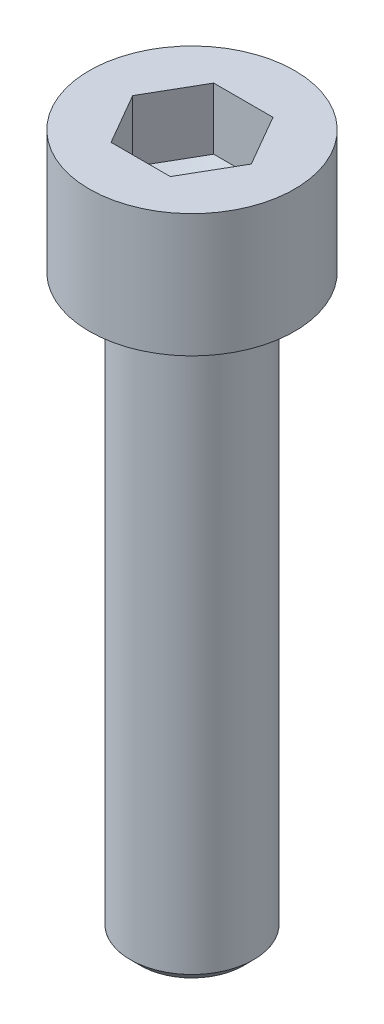
ISO-10303-21;
HEADER;
FILE_DESCRIPTION(('STEP AP214'),'2;1');
FILE_NAME('part.step','',(''),(''),'','','');
FILE_SCHEMA(('AUTOMOTIVE_DESIGN { 1 0 10303 214 1 1 1 1 }'));
ENDSEC;
DATA;
#1=APPLICATION_CONTEXT('core data for automotive mechanical design processes');
#2=APPLICATION_PROTOCOL_DEFINITION('international standard','automotive_design',2000,#1);
#3=PRODUCT_CONTEXT('',#1,'mechanical');
#4=PRODUCT('Part','Part','',(#3));
#5=PRODUCT_RELATED_PRODUCT_CATEGORY('part','',(#4));
#6=PRODUCT_DEFINITION_FORMATION('','',#4);
#7=PRODUCT_DEFINITION_CONTEXT('part definition',#1,'design');
#8=PRODUCT_DEFINITION('design','',#6,#7);
#9=PRODUCT_DEFINITION_SHAPE('','',#8);
#10=(LENGTH_UNIT() NAMED_UNIT(*) SI_UNIT(.MILLI.,.METRE.));
#11=(NAMED_UNIT(*) PLANE_ANGLE_UNIT() SI_UNIT($,.RADIAN.));
#12=(NAMED_UNIT(*) SI_UNIT($,.STERADIAN.) SOLID_ANGLE_UNIT());
#13=UNCERTAINTY_MEASURE_WITH_UNIT(LENGTH_MEASURE(1.E-05),#10,'distance_accuracy_value','');
#14=(GEOMETRIC_REPRESENTATION_CONTEXT(3) GLOBAL_UNCERTAINTY_ASSIGNED_CONTEXT((#13)) GLOBAL_UNIT_ASSIGNED_CONTEXT((#10,
#11,#12)) REPRESENTATION_CONTEXT('',''));
#15=CARTESIAN_POINT('',(0.,0.,0.));
#16=DIRECTION('',(0.,0.,1.));
#17=DIRECTION('',(1.,0.,0.));
#18=AXIS2_PLACEMENT_3D('',#15,#16,#17);
#19=CARTESIAN_POINT('',(0.,-27.5,0.));
#20=DIRECTION('',(0.,1.,0.));
#21=DIRECTION('',(0.,0.,-1.));
#22=AXIS2_PLACEMENT_3D('',#19,#20,#21);
#23=CONICAL_SURFACE('',#22,3.,0.785398163397449);
#24=CARTESIAN_POINT('',(0.,-28.,0.));
#25=DIRECTION('',(0.,-1.,0.));
#26=DIRECTION('',(0.,0.,-1.));
#27=AXIS2_PLACEMENT_3D('',#24,#25,#26);
#28=CIRCLE('',#27,2.5);
#29=CARTESIAN_POINT('',(0.,-28.,-2.5));
#30=VERTEX_POINT('',#29);
#31=EDGE_CURVE('E11',#30,#30,#28,.T.);
#32=ORIENTED_EDGE('',*,*,#31,.F.);
#33=EDGE_LOOP('',(#32));
#34=FACE_BOUND('',#33,.T.);
#35=CARTESIAN_POINT('',(0.,-27.5,0.));
#36=DIRECTION('',(0.,-1.,0.));
#37=DIRECTION('',(0.,0.,-1.));
#38=AXIS2_PLACEMENT_3D('',#35,#36,#37);
#39=CIRCLE('',#38,3.);
#40=CARTESIAN_POINT('',(0.,-27.5,-3.));
#41=VERTEX_POINT('',#40);
#42=EDGE_CURVE('E47',#41,#41,#39,.T.);
#43=ORIENTED_EDGE('',*,*,#42,.T.);
#44=EDGE_LOOP('',(#43));
#45=FACE_BOUND('',#44,.T.);
#46=ADVANCED_FACE('F41',(#34,#45),#23,.T.);
#47=CARTESIAN_POINT('',(0.,-28.,0.));
#48=DIRECTION('',(0.,-1.,0.));
#49=DIRECTION('',(0.,0.,-1.));
#50=AXIS2_PLACEMENT_3D('',#47,#48,#49);
#51=PLANE('',#50);
#52=ORIENTED_EDGE('',*,*,#31,.T.);
#53=EDGE_LOOP('',(#52));
#54=FACE_BOUND('',#53,.T.);
#55=ADVANCED_FACE('F56',(#54),#51,.T.);
#56=CARTESIAN_POINT('',(0.,-27.5,0.));
#57=DIRECTION('',(0.,-1.,0.));
#58=DIRECTION('',(0.,0.,-1.));
#59=AXIS2_PLACEMENT_3D('',#56,#57,#58);
#60=PLANE('',#59);
#61=ORIENTED_EDGE('',*,*,#42,.F.);
#62=EDGE_LOOP('',(#61));
#63=FACE_BOUND('',#62,.T.);
#64=ADVANCED_FACE('F54',(#63),#60,.F.);
#65=CLOSED_SHELL('',(#46,#55,#64));
#66=MANIFOLD_SOLID_BREP('B2',#65);
#67=CARTESIAN_POINT('',(0.,0.,0.));
#68=DIRECTION('',(0.,1.,0.));
#69=DIRECTION('',(0.,0.,1.));
#70=AXIS2_PLACEMENT_3D('',#67,#68,#69);
#71=PLANE('',#70);
#72=CARTESIAN_POINT('',(0.,0.,0.));
#73=DIRECTION('',(0.,1.,0.));
#74=DIRECTION('',(0.,0.,1.));
#75=AXIS2_PLACEMENT_3D('',#72,#73,#74);
#76=CIRCLE('',#75,5.);
#77=CARTESIAN_POINT('',(0.,0.,5.));
#78=VERTEX_POINT('',#77);
#79=EDGE_CURVE('E159',#78,#78,#76,.T.);
#80=ORIENTED_EDGE('',*,*,#79,.F.);
#81=EDGE_LOOP('',(#80));
#82=FACE_BOUND('',#81,.T.);
#83=CARTESIAN_POINT('',(0.,0.,0.));
#84=DIRECTION('',(0.,1.,0.));
#85=DIRECTION('',(0.,0.,1.));
#86=AXIS2_PLACEMENT_3D('',#83,#84,#85);
#87=CIRCLE('',#86,3.);
#88=CARTESIAN_POINT('',(0.,0.,3.));
#89=VERTEX_POINT('',#88);
#90=EDGE_CURVE('E39',#89,#89,#87,.F.);
#91=ORIENTED_EDGE('',*,*,#90,.F.);
#92=EDGE_LOOP('',(#91));
#93=FACE_BOUND('',#92,.T.);
#94=ADVANCED_FACE('F82',(#82,#93),#71,.F.);
#95=CARTESIAN_POINT('',(0.,6.,0.));
#96=DIRECTION('',(0.,-1.,0.));
#97=DIRECTION('',(0.,0.,-1.));
#98=AXIS2_PLACEMENT_3D('',#95,#96,#97);
#99=CYLINDRICAL_SURFACE('',#98,5.);
#100=CARTESIAN_POINT('',(0.,6.,0.));
#101=DIRECTION('',(0.,1.,0.));
#102=DIRECTION('',(0.,0.,1.));
#103=AXIS2_PLACEMENT_3D('',#100,#101,#102);
#104=CIRCLE('',#103,5.);
#105=CARTESIAN_POINT('',(0.,6.,5.));
#106=VERTEX_POINT('',#105);
#107=EDGE_CURVE('E90',#106,#106,#104,.T.);
#108=ORIENTED_EDGE('',*,*,#107,.F.);
#109=EDGE_LOOP('',(#108));
#110=FACE_BOUND('',#109,.T.);
#111=ORIENTED_EDGE('',*,*,#79,.T.);
#112=EDGE_LOOP('',(#111));
#113=FACE_BOUND('',#112,.T.);
#114=ADVANCED_FACE('F84',(#110,#113),#99,.T.);
#115=CARTESIAN_POINT('',(0.,6.,0.));
#116=DIRECTION('',(0.,1.,0.));
#117=DIRECTION('',(0.,0.,1.));
#118=AXIS2_PLACEMENT_3D('',#115,#116,#117);
#119=PLANE('',#118);
#120=DIRECTION('',(0.5,0.,-0.866025403784439));
#121=VECTOR('',#120,1.);
#122=CARTESIAN_POINT('',(1.44337567297406,6.,2.5));
#123=LINE('',#122,#121);
#124=CARTESIAN_POINT('',(1.44337567297406,6.,2.5));
#125=VERTEX_POINT('',#124);
#126=CARTESIAN_POINT('',(2.88675134594813,6.,0.));
#127=VERTEX_POINT('',#126);
#128=EDGE_CURVE('E97',#125,#127,#123,.T.);
#129=ORIENTED_EDGE('',*,*,#128,.F.);
#130=DIRECTION('',(1.,0.,0.));
#131=VECTOR('',#130,1.);
#132=CARTESIAN_POINT('',(-1.44337567297407,6.,2.5));
#133=LINE('',#132,#131);
#134=CARTESIAN_POINT('',(-1.44337567297407,6.,2.5));
#135=VERTEX_POINT('',#134);
#136=EDGE_CURVE('E132',#135,#125,#133,.T.);
#137=ORIENTED_EDGE('',*,*,#136,.F.);
#138=DIRECTION('',(0.5,0.,0.866025403784439));
#139=VECTOR('',#138,1.);
#140=CARTESIAN_POINT('',(-2.88675134594813,6.,0.));
#141=LINE('',#140,#139);
#142=CARTESIAN_POINT('',(-2.88675134594813,6.,0.));
#143=VERTEX_POINT('',#142);
#144=EDGE_CURVE('E141',#143,#135,#141,.T.);
#145=ORIENTED_EDGE('',*,*,#144,.F.);
#146=DIRECTION('',(-0.5,0.,0.866025403784438));
#147=VECTOR('',#146,1.);
#148=CARTESIAN_POINT('',(-1.44337567297406,6.,-2.5));
#149=LINE('',#148,#147);
#150=CARTESIAN_POINT('',(-1.44337567297406,6.,-2.5));
#151=VERTEX_POINT('',#150);
#152=EDGE_CURVE('E147',#151,#143,#149,.T.);
#153=ORIENTED_EDGE('',*,*,#152,.F.);
#154=DIRECTION('',(-1.,0.,0.));
#155=VECTOR('',#154,1.);
#156=CARTESIAN_POINT('',(1.44337567297406,6.,-2.5));
#157=LINE('',#156,#155);
#158=CARTESIAN_POINT('',(1.44337567297406,6.,-2.5));
#159=VERTEX_POINT('',#158);
#160=EDGE_CURVE('E374',#159,#151,#157,.T.);
#161=ORIENTED_EDGE('',*,*,#160,.F.);
#162=DIRECTION('',(-0.5,0.,-0.866025403784439));
#163=VECTOR('',#162,1.);
#164=CARTESIAN_POINT('',(2.88675134594813,6.,0.));
#165=LINE('',#164,#163);
#166=EDGE_CURVE('E371',#127,#159,#165,.T.);
#167=ORIENTED_EDGE('',*,*,#166,.F.);
#168=EDGE_LOOP('',(#129,#137,#145,#153,#161,#167));
#169=FACE_BOUND('',#168,.T.);
#170=ORIENTED_EDGE('',*,*,#107,.T.);
#171=EDGE_LOOP('',(#170));
#172=FACE_BOUND('',#171,.T.);
#173=ADVANCED_FACE('F149',(#169,#172),#119,.T.);
#174=CARTESIAN_POINT('',(1.44337567297406,3.,2.5));
#175=DIRECTION('',(0.866025403784439,0.,0.5));
#176=DIRECTION('',(0.5,0.,-0.866025403784439));
#177=AXIS2_PLACEMENT_3D('',#174,#175,#176);
#178=PLANE('',#177);
#179=ORIENTED_EDGE('',*,*,#128,.T.);
#180=DIRECTION('',(0.,1.,0.));
#181=VECTOR('',#180,1.);
#182=CARTESIAN_POINT('',(2.88675134594813,3.,0.));
#183=LINE('',#182,#181);
#184=CARTESIAN_POINT('',(2.88675134594813,3.,0.));
#185=VERTEX_POINT('',#184);
#186=EDGE_CURVE('E166',#185,#127,#183,.T.);
#187=ORIENTED_EDGE('',*,*,#186,.F.);
#188=DIRECTION('',(0.5,0.,-0.866025403784439));
#189=VECTOR('',#188,1.);
#190=CARTESIAN_POINT('',(1.44337567297406,3.,2.5));
#191=LINE('',#190,#189);
#192=CARTESIAN_POINT('',(1.44337567297406,3.,2.5));
#193=VERTEX_POINT('',#192);
#194=EDGE_CURVE('E152',#193,#185,#191,.T.);
#195=ORIENTED_EDGE('',*,*,#194,.F.);
#196=DIRECTION('',(0.,1.,0.));
#197=VECTOR('',#196,1.);
#198=CARTESIAN_POINT('',(1.44337567297406,3.,2.5));
#199=LINE('',#198,#197);
#200=EDGE_CURVE('E137',#193,#125,#199,.T.);
#201=ORIENTED_EDGE('',*,*,#200,.T.);
#202=EDGE_LOOP('',(#179,#187,#195,#201));
#203=FACE_BOUND('',#202,.T.);
#204=ADVANCED_FACE('F202',(#203),#178,.F.);
#205=CARTESIAN_POINT('',(-1.44337567297407,3.,2.5));
#206=DIRECTION('',(0.,0.,1.));
#207=DIRECTION('',(1.,0.,0.));
#208=AXIS2_PLACEMENT_3D('',#205,#206,#207);
#209=PLANE('',#208);
#210=ORIENTED_EDGE('',*,*,#136,.T.);
#211=ORIENTED_EDGE('',*,*,#200,.F.);
#212=DIRECTION('',(1.,0.,0.));
#213=VECTOR('',#212,1.);
#214=CARTESIAN_POINT('',(-1.44337567297407,3.,2.5));
#215=LINE('',#214,#213);
#216=CARTESIAN_POINT('',(-1.44337567297407,3.,2.5));
#217=VERTEX_POINT('',#216);
#218=EDGE_CURVE('E134',#217,#193,#215,.T.);
#219=ORIENTED_EDGE('',*,*,#218,.F.);
#220=DIRECTION('',(0.,1.,0.));
#221=VECTOR('',#220,1.);
#222=CARTESIAN_POINT('',(-1.44337567297407,3.,2.5));
#223=LINE('',#222,#221);
#224=EDGE_CURVE('E127',#217,#135,#223,.T.);
#225=ORIENTED_EDGE('',*,*,#224,.T.);
#226=EDGE_LOOP('',(#210,#211,#219,#225));
#227=FACE_BOUND('',#226,.T.);
#228=ADVANCED_FACE('F129',(#227),#209,.F.);
#229=CARTESIAN_POINT('',(-2.88675134594813,3.,0.));
#230=DIRECTION('',(-0.866025403784439,0.,0.5));
#231=DIRECTION('',(0.5,0.,0.866025403784439));
#232=AXIS2_PLACEMENT_3D('',#229,#230,#231);
#233=PLANE('',#232);
#234=ORIENTED_EDGE('',*,*,#144,.T.);
#235=ORIENTED_EDGE('',*,*,#224,.F.);
#236=DIRECTION('',(0.5,0.,0.866025403784439));
#237=VECTOR('',#236,1.);
#238=CARTESIAN_POINT('',(-2.88675134594813,3.,0.));
#239=LINE('',#238,#237);
#240=CARTESIAN_POINT('',(-2.88675134594813,3.,0.));
#241=VERTEX_POINT('',#240);
#242=EDGE_CURVE('E367',#241,#217,#239,.T.);
#243=ORIENTED_EDGE('',*,*,#242,.F.);
#244=DIRECTION('',(0.,1.,0.));
#245=VECTOR('',#244,1.);
#246=CARTESIAN_POINT('',(-2.88675134594813,3.,0.));
#247=LINE('',#246,#245);
#248=EDGE_CURVE('E138',#241,#143,#247,.T.);
#249=ORIENTED_EDGE('',*,*,#248,.T.);
#250=EDGE_LOOP('',(#234,#235,#243,#249));
#251=FACE_BOUND('',#250,.T.);
#252=ADVANCED_FACE('F142',(#251),#233,.F.);
#253=CARTESIAN_POINT('',(-1.44337567297406,3.,-2.5));
#254=DIRECTION('',(-0.866025403784438,0.,-0.5));
#255=DIRECTION('',(-0.5,0.,0.866025403784439));
#256=AXIS2_PLACEMENT_3D('',#253,#254,#255);
#257=PLANE('',#256);
#258=ORIENTED_EDGE('',*,*,#152,.T.);
#259=ORIENTED_EDGE('',*,*,#248,.F.);
#260=DIRECTION('',(-0.5,0.,0.866025403784438));
#261=VECTOR('',#260,1.);
#262=CARTESIAN_POINT('',(-1.44337567297406,3.,-2.5));
#263=LINE('',#262,#261);
#264=CARTESIAN_POINT('',(-1.44337567297406,3.,-2.5));
#265=VERTEX_POINT('',#264);
#266=EDGE_CURVE('E364',#265,#241,#263,.T.);
#267=ORIENTED_EDGE('',*,*,#266,.F.);
#268=DIRECTION('',(0.,1.,0.));
#269=VECTOR('',#268,1.);
#270=CARTESIAN_POINT('',(-1.44337567297406,3.,-2.5));
#271=LINE('',#270,#269);
#272=EDGE_CURVE('E162',#265,#151,#271,.T.);
#273=ORIENTED_EDGE('',*,*,#272,.T.);
#274=EDGE_LOOP('',(#258,#259,#267,#273));
#275=FACE_BOUND('',#274,.T.);
#276=ADVANCED_FACE('F205',(#275),#257,.F.);
#277=CARTESIAN_POINT('',(1.44337567297406,3.,-2.5));
#278=DIRECTION('',(0.,0.,-1.));
#279=DIRECTION('',(-1.,0.,0.));
#280=AXIS2_PLACEMENT_3D('',#277,#278,#279);
#281=PLANE('',#280);
#282=ORIENTED_EDGE('',*,*,#160,.T.);
#283=ORIENTED_EDGE('',*,*,#272,.F.);
#284=DIRECTION('',(-1.,0.,0.));
#285=VECTOR('',#284,1.);
#286=CARTESIAN_POINT('',(1.44337567297406,3.,-2.5));
#287=LINE('',#286,#285);
#288=CARTESIAN_POINT('',(1.44337567297406,3.,-2.5));
#289=VERTEX_POINT('',#288);
#290=EDGE_CURVE('E361',#289,#265,#287,.T.);
#291=ORIENTED_EDGE('',*,*,#290,.F.);
#292=DIRECTION('',(0.,1.,0.));
#293=VECTOR('',#292,1.);
#294=CARTESIAN_POINT('',(1.44337567297406,3.,-2.5));
#295=LINE('',#294,#293);
#296=EDGE_CURVE('E164',#289,#159,#295,.T.);
#297=ORIENTED_EDGE('',*,*,#296,.T.);
#298=EDGE_LOOP('',(#282,#283,#291,#297));
#299=FACE_BOUND('',#298,.T.);
#300=ADVANCED_FACE('F208',(#299),#281,.F.);
#301=CARTESIAN_POINT('',(2.88675134594813,3.,0.));
#302=DIRECTION('',(0.866025403784439,0.,-0.5));
#303=DIRECTION('',(-0.5,0.,-0.866025403784439));
#304=AXIS2_PLACEMENT_3D('',#301,#302,#303);
#305=PLANE('',#304);
#306=ORIENTED_EDGE('',*,*,#166,.T.);
#307=ORIENTED_EDGE('',*,*,#296,.F.);
#308=DIRECTION('',(-0.5,0.,-0.866025403784439));
#309=VECTOR('',#308,1.);
#310=CARTESIAN_POINT('',(2.88675134594813,3.,0.));
#311=LINE('',#310,#309);
#312=EDGE_CURVE('E155',#185,#289,#311,.T.);
#313=ORIENTED_EDGE('',*,*,#312,.F.);
#314=ORIENTED_EDGE('',*,*,#186,.T.);
#315=EDGE_LOOP('',(#306,#307,#313,#314));
#316=FACE_BOUND('',#315,.T.);
#317=ADVANCED_FACE('F197',(#316),#305,.F.);
#318=CARTESIAN_POINT('',(0.,3.,0.));
#319=DIRECTION('',(0.,1.,0.));
#320=DIRECTION('',(0.,0.,1.));
#321=AXIS2_PLACEMENT_3D('',#318,#319,#320);
#322=PLANE('',#321);
#323=CARTESIAN_POINT('',(0.,3.,0.));
#324=DIRECTION('',(0.,1.,0.));
#325=DIRECTION('',(0.,0.,1.));
#326=AXIS2_PLACEMENT_3D('',#323,#324,#325);
#327=CIRCLE('',#326,2.88675134594813);
#328=EDGE_CURVE('E106',#193,#185,#327,.T.);
#329=ORIENTED_EDGE('',*,*,#328,.F.);
#330=ORIENTED_EDGE('',*,*,#194,.T.);
#331=EDGE_LOOP('',(#329,#330));
#332=FACE_BOUND('',#331,.T.);
#333=ADVANCED_FACE('F194',(#332),#322,.F.);
#334=EDGE_CURVE('E342',#217,#193,#327,.T.);
#335=ORIENTED_EDGE('',*,*,#334,.F.);
#336=ORIENTED_EDGE('',*,*,#218,.T.);
#337=EDGE_LOOP('',(#335,#336));
#338=FACE_BOUND('',#337,.T.);
#339=ADVANCED_FACE('F196',(#338),#322,.F.);
#340=EDGE_CURVE('E347',#241,#217,#327,.T.);
#341=ORIENTED_EDGE('',*,*,#340,.F.);
#342=ORIENTED_EDGE('',*,*,#242,.T.);
#343=EDGE_LOOP('',(#341,#342));
#344=FACE_BOUND('',#343,.T.);
#345=ADVANCED_FACE('F273',(#344),#322,.F.);
#346=EDGE_CURVE('E354',#265,#241,#327,.T.);
#347=ORIENTED_EDGE('',*,*,#346,.F.);
#348=ORIENTED_EDGE('',*,*,#266,.T.);
#349=EDGE_LOOP('',(#347,#348));
#350=FACE_BOUND('',#349,.T.);
#351=ADVANCED_FACE('F264',(#350),#322,.F.);
#352=EDGE_CURVE('E355',#289,#265,#327,.T.);
#353=ORIENTED_EDGE('',*,*,#352,.F.);
#354=ORIENTED_EDGE('',*,*,#290,.T.);
#355=EDGE_LOOP('',(#353,#354));
#356=FACE_BOUND('',#355,.T.);
#357=ADVANCED_FACE('F255',(#356),#322,.F.);
#358=EDGE_CURVE('E357',#185,#289,#327,.T.);
#359=ORIENTED_EDGE('',*,*,#358,.F.);
#360=ORIENTED_EDGE('',*,*,#312,.T.);
#361=EDGE_LOOP('',(#359,#360));
#362=FACE_BOUND('',#361,.T.);
#363=ADVANCED_FACE('F189',(#362),#322,.F.);
#364=CARTESIAN_POINT('',(0.,3.,0.));
#365=DIRECTION('',(0.,1.,0.));
#366=DIRECTION('',(0.,0.,1.));
#367=AXIS2_PLACEMENT_3D('',#364,#365,#366);
#368=CONICAL_SURFACE('',#367,2.88675134594813,1.30899693899575);
#369=CARTESIAN_POINT('',(0.,2.22649730810375,0.));
#370=VERTEX_POINT('',#369);
#371=VERTEX_LOOP('',#370);
#372=FACE_BOUND('',#371,.T.);
#373=ORIENTED_EDGE('',*,*,#328,.T.);
#374=ORIENTED_EDGE('',*,*,#358,.T.);
#375=ORIENTED_EDGE('',*,*,#352,.T.);
#376=ORIENTED_EDGE('',*,*,#346,.T.);
#377=ORIENTED_EDGE('',*,*,#340,.T.);
#378=ORIENTED_EDGE('',*,*,#334,.T.);
#379=EDGE_LOOP('',(#373,#374,#375,#376,#377,#378));
#380=FACE_BOUND('',#379,.T.);
#381=ADVANCED_FACE('F180',(#372,#380),#368,.F.);
#382=CARTESIAN_POINT('',(0.,-27.5,0.));
#383=DIRECTION('',(0.,1.,0.));
#384=DIRECTION('',(0.,0.,1.));
#385=AXIS2_PLACEMENT_3D('',#382,#383,#384);
#386=CYLINDRICAL_SURFACE('',#385,3.);
#387=CARTESIAN_POINT('',(0.,-27.5,0.));
#388=DIRECTION('',(0.,-1.,0.));
#389=DIRECTION('',(0.,0.,-1.));
#390=AXIS2_PLACEMENT_3D('',#387,#388,#389);
#391=CIRCLE('',#390,3.);
#392=CARTESIAN_POINT('',(0.,-27.5,-3.));
#393=VERTEX_POINT('',#392);
#394=EDGE_CURVE('E348',#393,#393,#391,.T.);
#395=ORIENTED_EDGE('',*,*,#394,.F.);
#396=EDGE_LOOP('',(#395));
#397=FACE_BOUND('',#396,.T.);
#398=ORIENTED_EDGE('',*,*,#90,.T.);
#399=EDGE_LOOP('',(#398));
#400=FACE_BOUND('',#399,.T.);
#401=ADVANCED_FACE('F177',(#397,#400),#386,.T.);
#402=CARTESIAN_POINT('',(0.,-27.5,0.));
#403=DIRECTION('',(0.,-1.,0.));
#404=DIRECTION('',(0.,0.,-1.));
#405=AXIS2_PLACEMENT_3D('',#402,#403,#404);
#406=PLANE('',#405);
#407=ORIENTED_EDGE('',*,*,#394,.T.);
#408=EDGE_LOOP('',(#407));
#409=FACE_BOUND('',#408,.T.);
#410=ADVANCED_FACE('F179',(#409),#406,.T.);
#411=CLOSED_SHELL('',(#94,#114,#173,#204,#228,#252,#276,#300,#317,#333,#339,#345,#351,#357,#363,
#381,#401,#410));
#412=MANIFOLD_SOLID_BREP('B6',#411);
#413=ADVANCED_BREP_SHAPE_REPRESENTATION('',(#18,#66,#412),#14);
#414=SHAPE_DEFINITION_REPRESENTATION(#9,#413);
ENDSEC;
END-ISO-10303-21;
